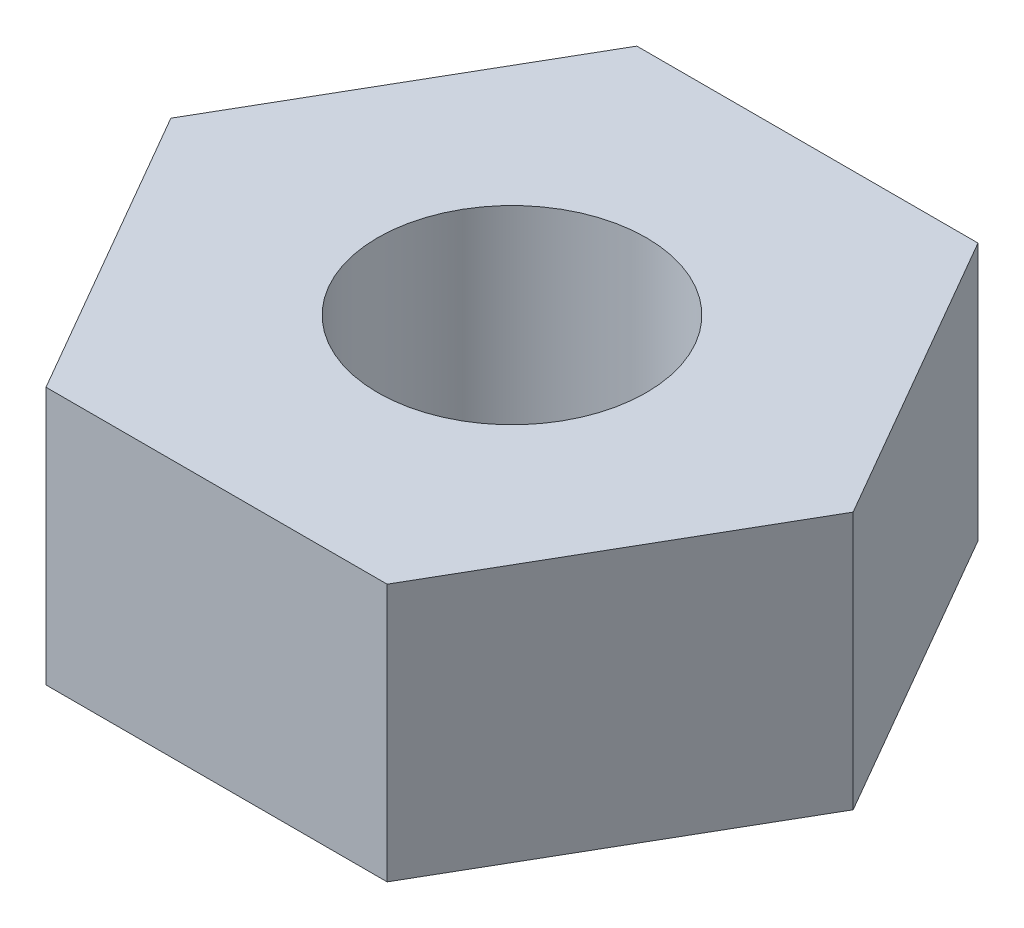
ISO-10303-21;
HEADER;
FILE_DESCRIPTION(('STEP AP214'),'2;1');
FILE_NAME('part.step','',(''),(''),'','','');
FILE_SCHEMA(('AUTOMOTIVE_DESIGN { 1 0 10303 214 1 1 1 1 }'));
ENDSEC;
DATA;
#1=APPLICATION_CONTEXT('core data for automotive mechanical design processes');
#2=APPLICATION_PROTOCOL_DEFINITION('international standard','automotive_design',2000,#1);
#3=PRODUCT_CONTEXT('',#1,'mechanical');
#4=PRODUCT('Part','Part','',(#3));
#5=PRODUCT_RELATED_PRODUCT_CATEGORY('part','',(#4));
#6=PRODUCT_DEFINITION_FORMATION('','',#4);
#7=PRODUCT_DEFINITION_CONTEXT('part definition',#1,'design');
#8=PRODUCT_DEFINITION('design','',#6,#7);
#9=PRODUCT_DEFINITION_SHAPE('','',#8);
#10=(LENGTH_UNIT() NAMED_UNIT(*) SI_UNIT(.MILLI.,.METRE.));
#11=(NAMED_UNIT(*) PLANE_ANGLE_UNIT() SI_UNIT($,.RADIAN.));
#12=(NAMED_UNIT(*) SI_UNIT($,.STERADIAN.) SOLID_ANGLE_UNIT());
#13=UNCERTAINTY_MEASURE_WITH_UNIT(LENGTH_MEASURE(1.E-05),#10,'distance_accuracy_value','');
#14=(GEOMETRIC_REPRESENTATION_CONTEXT(3) GLOBAL_UNCERTAINTY_ASSIGNED_CONTEXT((#13)) GLOBAL_UNIT_ASSIGNED_CONTEXT((#10,
#11,#12)) REPRESENTATION_CONTEXT('',''));
#15=CARTESIAN_POINT('',(0.,0.,0.));
#16=DIRECTION('',(0.,0.,1.));
#17=DIRECTION('',(1.,0.,0.));
#18=AXIS2_PLACEMENT_3D('',#15,#16,#17);
#19=CARTESIAN_POINT('',(-1.58771324027148,2.4,-2.75000000000001));
#20=DIRECTION('',(0.,1.,0.));
#21=DIRECTION('',(0.,0.,1.));
#22=AXIS2_PLACEMENT_3D('',#19,#20,#21);
#23=PLANE('',#22);
#24=DIRECTION('',(-1.,0.,0.));
#25=VECTOR('',#24,1.);
#26=CARTESIAN_POINT('',(1.58771324027146,2.4,-2.75));
#27=LINE('',#26,#25);
#28=CARTESIAN_POINT('',(1.58771324027146,2.4,-2.75));
#29=VERTEX_POINT('',#28);
#30=CARTESIAN_POINT('',(-1.58771324027148,2.4,-2.75000000000001));
#31=VERTEX_POINT('',#30);
#32=EDGE_CURVE('E128',#29,#31,#27,.T.);
#33=ORIENTED_EDGE('',*,*,#32,.T.);
#34=DIRECTION('',(-0.5,0.,0.866025403784439));
#35=VECTOR('',#34,1.);
#36=CARTESIAN_POINT('',(-1.58771324027148,2.4,-2.75000000000001));
#37=LINE('',#36,#35);
#38=CARTESIAN_POINT('',(-3.17542648054295,2.4,0.));
#39=VERTEX_POINT('',#38);
#40=EDGE_CURVE('E86',#31,#39,#37,.T.);
#41=ORIENTED_EDGE('',*,*,#40,.T.);
#42=DIRECTION('',(0.5,0.,0.866025403784438));
#43=VECTOR('',#42,1.);
#44=CARTESIAN_POINT('',(-3.17542648054295,2.4,0.));
#45=LINE('',#44,#43);
#46=CARTESIAN_POINT('',(-1.58771324027148,2.4,2.74999999999999));
#47=VERTEX_POINT('',#46);
#48=EDGE_CURVE('E99',#39,#47,#45,.T.);
#49=ORIENTED_EDGE('',*,*,#48,.T.);
#50=DIRECTION('',(1.,0.,0.));
#51=VECTOR('',#50,1.);
#52=CARTESIAN_POINT('',(-1.58771324027148,2.4,2.74999999999999));
#53=LINE('',#52,#51);
#54=CARTESIAN_POINT('',(1.58771324027147,2.4,2.74999999999999));
#55=VERTEX_POINT('',#54);
#56=EDGE_CURVE('E93',#47,#55,#53,.T.);
#57=ORIENTED_EDGE('',*,*,#56,.T.);
#58=DIRECTION('',(0.500000000000001,0.,-0.866025403784438));
#59=VECTOR('',#58,1.);
#60=CARTESIAN_POINT('',(1.58771324027147,2.4,2.74999999999999));
#61=LINE('',#60,#59);
#62=CARTESIAN_POINT('',(3.17542648054293,2.4,0.));
#63=VERTEX_POINT('',#62);
#64=EDGE_CURVE('E97',#55,#63,#61,.T.);
#65=ORIENTED_EDGE('',*,*,#64,.T.);
#66=DIRECTION('',(-0.5,0.,-0.866025403784439));
#67=VECTOR('',#66,1.);
#68=CARTESIAN_POINT('',(3.17542648054293,2.4,0.));
#69=LINE('',#68,#67);
#70=EDGE_CURVE('E49',#63,#29,#69,.T.);
#71=ORIENTED_EDGE('',*,*,#70,.T.);
#72=EDGE_LOOP('',(#33,#41,#49,#57,#65,#71));
#73=FACE_BOUND('',#72,.T.);
#74=CARTESIAN_POINT('',(0.,2.4,0.));
#75=DIRECTION('',(0.,1.,0.));
#76=DIRECTION('',(0.,0.,1.));
#77=AXIS2_PLACEMENT_3D('',#74,#75,#76);
#78=CIRCLE('',#77,1.25);
#79=CARTESIAN_POINT('',(0.,2.4,1.25));
#80=VERTEX_POINT('',#79);
#81=EDGE_CURVE('E121',#80,#80,#78,.T.);
#82=ORIENTED_EDGE('',*,*,#81,.F.);
#83=EDGE_LOOP('',(#82));
#84=FACE_BOUND('',#83,.T.);
#85=ADVANCED_FACE('F32',(#73,#84),#23,.T.);
#86=CARTESIAN_POINT('',(-1.58771324027148,0.,-2.75000000000001));
#87=DIRECTION('',(0.,1.,0.));
#88=DIRECTION('',(0.,0.,1.));
#89=AXIS2_PLACEMENT_3D('',#86,#87,#88);
#90=PLANE('',#89);
#91=DIRECTION('',(-1.,0.,0.));
#92=VECTOR('',#91,1.);
#93=CARTESIAN_POINT('',(1.58771324027146,0.,-2.75));
#94=LINE('',#93,#92);
#95=CARTESIAN_POINT('',(1.58771324027146,0.,-2.75));
#96=VERTEX_POINT('',#95);
#97=CARTESIAN_POINT('',(-1.58771324027148,0.,-2.75000000000001));
#98=VERTEX_POINT('',#97);
#99=EDGE_CURVE('E117',#96,#98,#94,.T.);
#100=ORIENTED_EDGE('',*,*,#99,.F.);
#101=DIRECTION('',(-0.5,0.,-0.866025403784439));
#102=VECTOR('',#101,1.);
#103=CARTESIAN_POINT('',(3.17542648054293,0.,0.));
#104=LINE('',#103,#102);
#105=CARTESIAN_POINT('',(3.17542648054293,0.,0.));
#106=VERTEX_POINT('',#105);
#107=EDGE_CURVE('E78',#106,#96,#104,.T.);
#108=ORIENTED_EDGE('',*,*,#107,.F.);
#109=DIRECTION('',(0.500000000000001,0.,-0.866025403784438));
#110=VECTOR('',#109,1.);
#111=CARTESIAN_POINT('',(1.58771324027147,0.,2.74999999999999));
#112=LINE('',#111,#110);
#113=CARTESIAN_POINT('',(1.58771324027147,0.,2.74999999999999));
#114=VERTEX_POINT('',#113);
#115=EDGE_CURVE('E72',#114,#106,#112,.T.);
#116=ORIENTED_EDGE('',*,*,#115,.F.);
#117=DIRECTION('',(1.,0.,0.));
#118=VECTOR('',#117,1.);
#119=CARTESIAN_POINT('',(-1.58771324027148,0.,2.74999999999999));
#120=LINE('',#119,#118);
#121=CARTESIAN_POINT('',(-1.58771324027148,0.,2.74999999999999));
#122=VERTEX_POINT('',#121);
#123=EDGE_CURVE('E107',#122,#114,#120,.T.);
#124=ORIENTED_EDGE('',*,*,#123,.F.);
#125=DIRECTION('',(0.5,0.,0.866025403784438));
#126=VECTOR('',#125,1.);
#127=CARTESIAN_POINT('',(-3.17542648054295,0.,0.));
#128=LINE('',#127,#126);
#129=CARTESIAN_POINT('',(-3.17542648054295,0.,0.));
#130=VERTEX_POINT('',#129);
#131=EDGE_CURVE('E123',#130,#122,#128,.T.);
#132=ORIENTED_EDGE('',*,*,#131,.F.);
#133=DIRECTION('',(-0.5,0.,0.866025403784439));
#134=VECTOR('',#133,1.);
#135=CARTESIAN_POINT('',(-1.58771324027148,0.,-2.75000000000001));
#136=LINE('',#135,#134);
#137=EDGE_CURVE('E120',#98,#130,#136,.T.);
#138=ORIENTED_EDGE('',*,*,#137,.F.);
#139=EDGE_LOOP('',(#100,#108,#116,#124,#132,#138));
#140=FACE_BOUND('',#139,.T.);
#141=CARTESIAN_POINT('',(0.,0.,0.));
#142=DIRECTION('',(0.,1.,0.));
#143=DIRECTION('',(0.,0.,1.));
#144=AXIS2_PLACEMENT_3D('',#141,#142,#143);
#145=CIRCLE('',#144,1.25);
#146=CARTESIAN_POINT('',(0.,0.,1.25));
#147=VERTEX_POINT('',#146);
#148=EDGE_CURVE('E221',#147,#147,#145,.T.);
#149=ORIENTED_EDGE('',*,*,#148,.T.);
#150=EDGE_LOOP('',(#149));
#151=FACE_BOUND('',#150,.T.);
#152=ADVANCED_FACE('F137',(#140,#151),#90,.F.);
#153=CARTESIAN_POINT('',(1.58771324027146,2.4,-2.75));
#154=DIRECTION('',(0.,0.,1.));
#155=DIRECTION('',(1.,0.,0.));
#156=AXIS2_PLACEMENT_3D('',#153,#154,#155);
#157=PLANE('',#156);
#158=ORIENTED_EDGE('',*,*,#99,.T.);
#159=DIRECTION('',(0.,-1.,0.));
#160=VECTOR('',#159,1.);
#161=CARTESIAN_POINT('',(-1.58771324027148,2.4,-2.75000000000001));
#162=LINE('',#161,#160);
#163=EDGE_CURVE('E11',#31,#98,#162,.T.);
#164=ORIENTED_EDGE('',*,*,#163,.F.);
#165=ORIENTED_EDGE('',*,*,#32,.F.);
#166=DIRECTION('',(0.,-1.,0.));
#167=VECTOR('',#166,1.);
#168=CARTESIAN_POINT('',(1.58771324027146,2.4,-2.75));
#169=LINE('',#168,#167);
#170=EDGE_CURVE('E113',#29,#96,#169,.T.);
#171=ORIENTED_EDGE('',*,*,#170,.T.);
#172=EDGE_LOOP('',(#158,#164,#165,#171));
#173=FACE_BOUND('',#172,.T.);
#174=ADVANCED_FACE('F34',(#173),#157,.F.);
#175=CARTESIAN_POINT('',(-1.58771324027148,2.4,-2.75000000000001));
#176=DIRECTION('',(0.866025403784439,0.,0.5));
#177=DIRECTION('',(0.5,0.,-0.866025403784439));
#178=AXIS2_PLACEMENT_3D('',#175,#176,#177);
#179=PLANE('',#178);
#180=ORIENTED_EDGE('',*,*,#137,.T.);
#181=DIRECTION('',(0.,-1.,0.));
#182=VECTOR('',#181,1.);
#183=CARTESIAN_POINT('',(-3.17542648054295,2.4,0.));
#184=LINE('',#183,#182);
#185=EDGE_CURVE('E41',#39,#130,#184,.T.);
#186=ORIENTED_EDGE('',*,*,#185,.F.);
#187=ORIENTED_EDGE('',*,*,#40,.F.);
#188=ORIENTED_EDGE('',*,*,#163,.T.);
#189=EDGE_LOOP('',(#180,#186,#187,#188));
#190=FACE_BOUND('',#189,.T.);
#191=ADVANCED_FACE('F162',(#190),#179,.F.);
#192=CARTESIAN_POINT('',(-3.17542648054295,2.4,0.));
#193=DIRECTION('',(0.866025403784438,0.,-0.5));
#194=DIRECTION('',(-0.5,0.,-0.866025403784439));
#195=AXIS2_PLACEMENT_3D('',#192,#193,#194);
#196=PLANE('',#195);
#197=ORIENTED_EDGE('',*,*,#131,.T.);
#198=DIRECTION('',(0.,-1.,0.));
#199=VECTOR('',#198,1.);
#200=CARTESIAN_POINT('',(-1.58771324027148,2.4,2.74999999999999));
#201=LINE('',#200,#199);
#202=EDGE_CURVE('E108',#47,#122,#201,.T.);
#203=ORIENTED_EDGE('',*,*,#202,.F.);
#204=ORIENTED_EDGE('',*,*,#48,.F.);
#205=ORIENTED_EDGE('',*,*,#185,.T.);
#206=EDGE_LOOP('',(#197,#203,#204,#205));
#207=FACE_BOUND('',#206,.T.);
#208=ADVANCED_FACE('F134',(#207),#196,.F.);
#209=CARTESIAN_POINT('',(-1.58771324027148,2.4,2.74999999999999));
#210=DIRECTION('',(0.,0.,-1.));
#211=DIRECTION('',(-1.,0.,0.));
#212=AXIS2_PLACEMENT_3D('',#209,#210,#211);
#213=PLANE('',#212);
#214=ORIENTED_EDGE('',*,*,#123,.T.);
#215=DIRECTION('',(0.,-1.,0.));
#216=VECTOR('',#215,1.);
#217=CARTESIAN_POINT('',(1.58771324027147,2.4,2.74999999999999));
#218=LINE('',#217,#216);
#219=EDGE_CURVE('E104',#55,#114,#218,.T.);
#220=ORIENTED_EDGE('',*,*,#219,.F.);
#221=ORIENTED_EDGE('',*,*,#56,.F.);
#222=ORIENTED_EDGE('',*,*,#202,.T.);
#223=EDGE_LOOP('',(#214,#220,#221,#222));
#224=FACE_BOUND('',#223,.T.);
#225=ADVANCED_FACE('F105',(#224),#213,.F.);
#226=CARTESIAN_POINT('',(1.58771324027147,2.4,2.74999999999999));
#227=DIRECTION('',(-0.866025403784438,0.,-0.500000000000001));
#228=DIRECTION('',(-0.500000000000001,0.,0.866025403784438));
#229=AXIS2_PLACEMENT_3D('',#226,#227,#228);
#230=PLANE('',#229);
#231=ORIENTED_EDGE('',*,*,#115,.T.);
#232=DIRECTION('',(0.,-1.,0.));
#233=VECTOR('',#232,1.);
#234=CARTESIAN_POINT('',(3.17542648054293,2.4,0.));
#235=LINE('',#234,#233);
#236=EDGE_CURVE('E109',#63,#106,#235,.T.);
#237=ORIENTED_EDGE('',*,*,#236,.F.);
#238=ORIENTED_EDGE('',*,*,#64,.F.);
#239=ORIENTED_EDGE('',*,*,#219,.T.);
#240=EDGE_LOOP('',(#231,#237,#238,#239));
#241=FACE_BOUND('',#240,.T.);
#242=ADVANCED_FACE('F111',(#241),#230,.F.);
#243=CARTESIAN_POINT('',(3.17542648054293,2.4,0.));
#244=DIRECTION('',(-0.866025403784439,0.,0.5));
#245=DIRECTION('',(0.5,0.,0.866025403784439));
#246=AXIS2_PLACEMENT_3D('',#243,#244,#245);
#247=PLANE('',#246);
#248=ORIENTED_EDGE('',*,*,#107,.T.);
#249=ORIENTED_EDGE('',*,*,#170,.F.);
#250=ORIENTED_EDGE('',*,*,#70,.F.);
#251=ORIENTED_EDGE('',*,*,#236,.T.);
#252=EDGE_LOOP('',(#248,#249,#250,#251));
#253=FACE_BOUND('',#252,.T.);
#254=ADVANCED_FACE('F142',(#253),#247,.F.);
#255=CARTESIAN_POINT('',(0.,2.4,0.));
#256=DIRECTION('',(0.,-1.,0.));
#257=DIRECTION('',(0.,0.,-1.));
#258=AXIS2_PLACEMENT_3D('',#255,#256,#257);
#259=CYLINDRICAL_SURFACE('',#258,1.25);
#260=ORIENTED_EDGE('',*,*,#81,.T.);
#261=EDGE_LOOP('',(#260));
#262=FACE_BOUND('',#261,.T.);
#263=ORIENTED_EDGE('',*,*,#148,.F.);
#264=EDGE_LOOP('',(#263));
#265=FACE_BOUND('',#264,.T.);
#266=ADVANCED_FACE('F144',(#262,#265),#259,.F.);
#267=CLOSED_SHELL('',(#85,#152,#174,#191,#208,#225,#242,#254,#266));
#268=MANIFOLD_SOLID_BREP('B2',#267);
#269=ADVANCED_BREP_SHAPE_REPRESENTATION('',(#18,#268),#14);
#270=SHAPE_DEFINITION_REPRESENTATION(#9,#269);
ENDSEC;
END-ISO-10303-21;
